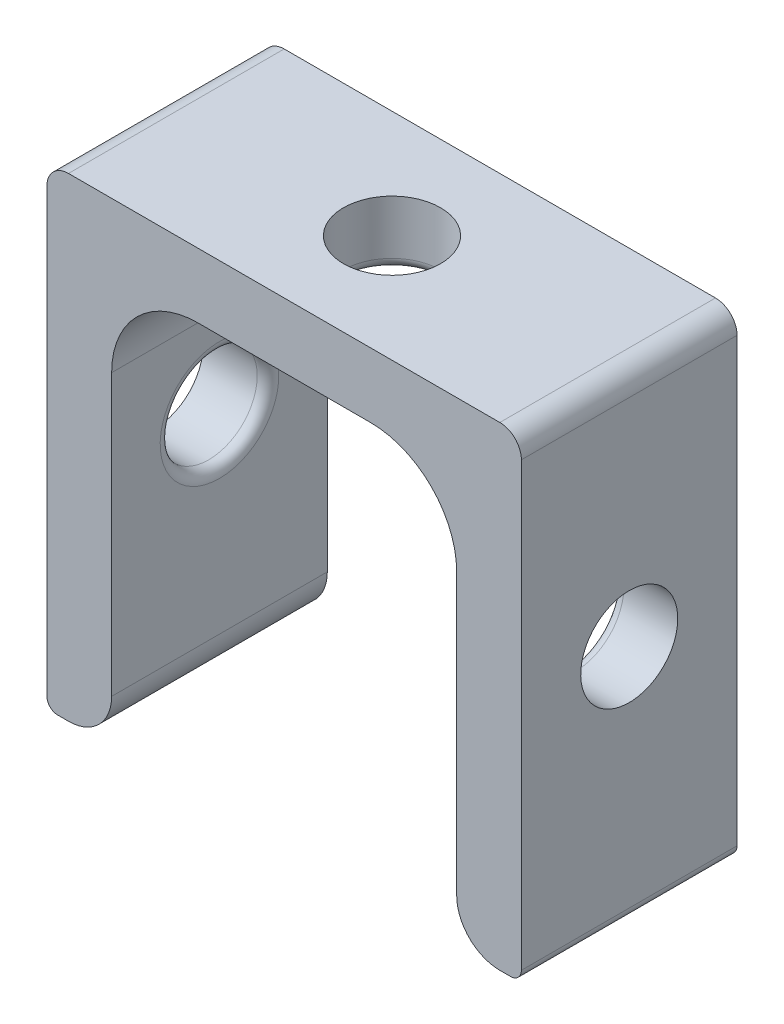
ISO-10303-21;
HEADER;
FILE_DESCRIPTION(('STEP AP214'),'2;1');
FILE_NAME('part.step','',(''),(''),'','','');
FILE_SCHEMA(('AUTOMOTIVE_DESIGN { 1 0 10303 214 1 1 1 1 }'));
ENDSEC;
DATA;
#1=APPLICATION_CONTEXT('core data for automotive mechanical design processes');
#2=APPLICATION_PROTOCOL_DEFINITION('international standard','automotive_design',2000,#1);
#3=PRODUCT_CONTEXT('',#1,'mechanical');
#4=PRODUCT('Part','Part','',(#3));
#5=PRODUCT_RELATED_PRODUCT_CATEGORY('part','',(#4));
#6=PRODUCT_DEFINITION_FORMATION('','',#4);
#7=PRODUCT_DEFINITION_CONTEXT('part definition',#1,'design');
#8=PRODUCT_DEFINITION('design','',#6,#7);
#9=PRODUCT_DEFINITION_SHAPE('','',#8);
#10=(LENGTH_UNIT() NAMED_UNIT(*) SI_UNIT(.MILLI.,.METRE.));
#11=(NAMED_UNIT(*) PLANE_ANGLE_UNIT() SI_UNIT($,.RADIAN.));
#12=(NAMED_UNIT(*) SI_UNIT($,.STERADIAN.) SOLID_ANGLE_UNIT());
#13=UNCERTAINTY_MEASURE_WITH_UNIT(LENGTH_MEASURE(1.E-05),#10,'distance_accuracy_value','');
#14=(GEOMETRIC_REPRESENTATION_CONTEXT(3) GLOBAL_UNCERTAINTY_ASSIGNED_CONTEXT((#13)) GLOBAL_UNIT_ASSIGNED_CONTEXT((#10,
#11,#12)) REPRESENTATION_CONTEXT('',''));
#15=CARTESIAN_POINT('',(0.,0.,0.));
#16=DIRECTION('',(0.,0.,1.));
#17=DIRECTION('',(1.,0.,0.));
#18=AXIS2_PLACEMENT_3D('',#15,#16,#17);
#19=CARTESIAN_POINT('',(-10.5,-18.5,10.));
#20=DIRECTION('',(0.,0.,-1.));
#21=DIRECTION('',(-1.,0.,0.));
#22=AXIS2_PLACEMENT_3D('',#19,#20,#21);
#23=CYLINDRICAL_SURFACE('',#22,0.500000000000002);
#24=CARTESIAN_POINT('',(-10.5,-18.5,0.));
#25=DIRECTION('',(0.,0.,1.));
#26=DIRECTION('',(1.,0.,0.));
#27=AXIS2_PLACEMENT_3D('',#24,#25,#26);
#28=CIRCLE('',#27,0.500000000000002);
#29=CARTESIAN_POINT('',(-11.,-18.5,0.));
#30=VERTEX_POINT('',#29);
#31=CARTESIAN_POINT('',(-10.5,-19.,0.));
#32=VERTEX_POINT('',#31);
#33=EDGE_CURVE('E173',#30,#32,#28,.T.);
#34=ORIENTED_EDGE('',*,*,#33,.T.);
#35=DIRECTION('',(0.,0.,-1.));
#36=VECTOR('',#35,1.);
#37=CARTESIAN_POINT('',(-10.5,-19.,10.));
#38=LINE('',#37,#36);
#39=CARTESIAN_POINT('',(-10.5,-19.,10.));
#40=VERTEX_POINT('',#39);
#41=EDGE_CURVE('E153',#40,#32,#38,.T.);
#42=ORIENTED_EDGE('',*,*,#41,.F.);
#43=CARTESIAN_POINT('',(-10.5,-18.5,10.));
#44=DIRECTION('',(0.,0.,1.));
#45=DIRECTION('',(1.,0.,0.));
#46=AXIS2_PLACEMENT_3D('',#43,#44,#45);
#47=CIRCLE('',#46,0.500000000000002);
#48=CARTESIAN_POINT('',(-11.,-18.5,10.));
#49=VERTEX_POINT('',#48);
#50=EDGE_CURVE('E160',#49,#40,#47,.T.);
#51=ORIENTED_EDGE('',*,*,#50,.F.);
#52=DIRECTION('',(0.,0.,-1.));
#53=VECTOR('',#52,1.);
#54=CARTESIAN_POINT('',(-11.,-18.5,10.));
#55=LINE('',#54,#53);
#56=EDGE_CURVE('E282',#49,#30,#55,.T.);
#57=ORIENTED_EDGE('',*,*,#56,.T.);
#58=EDGE_LOOP('',(#34,#42,#51,#57));
#59=FACE_BOUND('',#58,.T.);
#60=ADVANCED_FACE('F36',(#59),#23,.T.);
#61=CARTESIAN_POINT('',(-10.,-19.,10.));
#62=DIRECTION('',(0.,1.,0.));
#63=DIRECTION('',(0.,0.,1.));
#64=AXIS2_PLACEMENT_3D('',#61,#62,#63);
#65=PLANE('',#64);
#66=DIRECTION('',(1.,0.,0.));
#67=VECTOR('',#66,1.);
#68=CARTESIAN_POINT('',(-10.,-19.,0.));
#69=LINE('',#68,#67);
#70=CARTESIAN_POINT('',(-10.,-19.,0.));
#71=VERTEX_POINT('',#70);
#72=EDGE_CURVE('E299',#32,#71,#69,.T.);
#73=ORIENTED_EDGE('',*,*,#72,.T.);
#74=DIRECTION('',(0.,0.,-1.));
#75=VECTOR('',#74,1.);
#76=CARTESIAN_POINT('',(-10.,-19.,10.));
#77=LINE('',#76,#75);
#78=CARTESIAN_POINT('',(-10.,-19.,10.));
#79=VERTEX_POINT('',#78);
#80=EDGE_CURVE('E156',#79,#71,#77,.T.);
#81=ORIENTED_EDGE('',*,*,#80,.F.);
#82=DIRECTION('',(1.,0.,0.));
#83=VECTOR('',#82,1.);
#84=CARTESIAN_POINT('',(-10.,-19.,10.));
#85=LINE('',#84,#83);
#86=EDGE_CURVE('E149',#40,#79,#85,.T.);
#87=ORIENTED_EDGE('',*,*,#86,.F.);
#88=ORIENTED_EDGE('',*,*,#41,.T.);
#89=EDGE_LOOP('',(#73,#81,#87,#88));
#90=FACE_BOUND('',#89,.T.);
#91=ADVANCED_FACE('F151',(#90),#65,.F.);
#92=CARTESIAN_POINT('',(-10.,-17.,10.));
#93=DIRECTION('',(0.,0.,-1.));
#94=DIRECTION('',(-1.,0.,0.));
#95=AXIS2_PLACEMENT_3D('',#92,#93,#94);
#96=CYLINDRICAL_SURFACE('',#95,2.);
#97=CARTESIAN_POINT('',(-10.,-17.,0.));
#98=DIRECTION('',(0.,0.,1.));
#99=DIRECTION('',(-1.,0.,0.));
#100=AXIS2_PLACEMENT_3D('',#97,#98,#99);
#101=CIRCLE('',#100,2.);
#102=CARTESIAN_POINT('',(-8.,-17.,0.));
#103=VERTEX_POINT('',#102);
#104=EDGE_CURVE('E266',#71,#103,#101,.T.);
#105=ORIENTED_EDGE('',*,*,#104,.T.);
#106=DIRECTION('',(0.,0.,-1.));
#107=VECTOR('',#106,1.);
#108=CARTESIAN_POINT('',(-8.,-17.,10.));
#109=LINE('',#108,#107);
#110=CARTESIAN_POINT('',(-8.,-17.,10.));
#111=VERTEX_POINT('',#110);
#112=EDGE_CURVE('E179',#111,#103,#109,.T.);
#113=ORIENTED_EDGE('',*,*,#112,.F.);
#114=CARTESIAN_POINT('',(-10.,-17.,10.));
#115=DIRECTION('',(0.,0.,1.));
#116=DIRECTION('',(-1.,0.,0.));
#117=AXIS2_PLACEMENT_3D('',#114,#115,#116);
#118=CIRCLE('',#117,2.);
#119=EDGE_CURVE('E159',#79,#111,#118,.T.);
#120=ORIENTED_EDGE('',*,*,#119,.F.);
#121=ORIENTED_EDGE('',*,*,#80,.T.);
#122=EDGE_LOOP('',(#105,#113,#120,#121));
#123=FACE_BOUND('',#122,.T.);
#124=ADVANCED_FACE('F363',(#123),#96,.T.);
#125=CARTESIAN_POINT('',(-8.,0.,10.));
#126=DIRECTION('',(-1.,0.,0.));
#127=DIRECTION('',(0.,-1.,0.));
#128=AXIS2_PLACEMENT_3D('',#125,#126,#127);
#129=PLANE('',#128);
#130=CARTESIAN_POINT('',(-8.,-8.,5.));
#131=DIRECTION('',(-1.,0.,0.));
#132=DIRECTION('',(0.,-1.,0.));
#133=AXIS2_PLACEMENT_3D('',#130,#131,#132);
#134=CIRCLE('',#133,2.75);
#135=CARTESIAN_POINT('',(-8.,-10.75,5.));
#136=VERTEX_POINT('',#135);
#137=EDGE_CURVE('E198',#136,#136,#134,.T.);
#138=ORIENTED_EDGE('',*,*,#137,.T.);
#139=EDGE_LOOP('',(#138));
#140=FACE_BOUND('',#139,.T.);
#141=DIRECTION('',(0.,1.,0.));
#142=VECTOR('',#141,1.);
#143=CARTESIAN_POINT('',(-8.,0.,0.));
#144=LINE('',#143,#142);
#145=CARTESIAN_POINT('',(-8.,-4.,0.));
#146=VERTEX_POINT('',#145);
#147=EDGE_CURVE('E262',#103,#146,#144,.T.);
#148=ORIENTED_EDGE('',*,*,#147,.T.);
#149=DIRECTION('',(0.,0.,-1.));
#150=VECTOR('',#149,1.);
#151=CARTESIAN_POINT('',(-8.,-4.,10.));
#152=LINE('',#151,#150);
#153=CARTESIAN_POINT('',(-8.,-4.,10.));
#154=VERTEX_POINT('',#153);
#155=EDGE_CURVE('E51',#146,#154,#152,.F.);
#156=ORIENTED_EDGE('',*,*,#155,.T.);
#157=DIRECTION('',(0.,1.,0.));
#158=VECTOR('',#157,1.);
#159=CARTESIAN_POINT('',(-8.,0.,10.));
#160=LINE('',#159,#158);
#161=EDGE_CURVE('E296',#111,#154,#160,.T.);
#162=ORIENTED_EDGE('',*,*,#161,.F.);
#163=ORIENTED_EDGE('',*,*,#112,.T.);
#164=EDGE_LOOP('',(#148,#156,#162,#163));
#165=FACE_BOUND('',#164,.T.);
#166=ADVANCED_FACE('F295',(#140,#165),#129,.F.);
#167=CARTESIAN_POINT('',(-8.,0.,10.));
#168=DIRECTION('',(0.,1.,0.));
#169=DIRECTION('',(0.,0.,1.));
#170=AXIS2_PLACEMENT_3D('',#167,#168,#169);
#171=PLANE('',#170);
#172=CARTESIAN_POINT('',(0.,0.,5.));
#173=DIRECTION('',(0.,1.,0.));
#174=DIRECTION('',(0.,0.,1.));
#175=AXIS2_PLACEMENT_3D('',#172,#173,#174);
#176=CIRCLE('',#175,2.75);
#177=CARTESIAN_POINT('',(0.,0.,7.75));
#178=VERTEX_POINT('',#177);
#179=EDGE_CURVE('E174',#178,#178,#176,.T.);
#180=ORIENTED_EDGE('',*,*,#179,.T.);
#181=EDGE_LOOP('',(#180));
#182=FACE_BOUND('',#181,.T.);
#183=DIRECTION('',(1.,0.,0.));
#184=VECTOR('',#183,1.);
#185=CARTESIAN_POINT('',(-8.,0.,0.));
#186=LINE('',#185,#184);
#187=CARTESIAN_POINT('',(-4.,0.,0.));
#188=VERTEX_POINT('',#187);
#189=CARTESIAN_POINT('',(4.,0.,0.));
#190=VERTEX_POINT('',#189);
#191=EDGE_CURVE('E256',#188,#190,#186,.T.);
#192=ORIENTED_EDGE('',*,*,#191,.T.);
#193=DIRECTION('',(0.,0.,-1.));
#194=VECTOR('',#193,1.);
#195=CARTESIAN_POINT('',(4.,0.,10.));
#196=LINE('',#195,#194);
#197=CARTESIAN_POINT('',(4.,0.,10.));
#198=VERTEX_POINT('',#197);
#199=EDGE_CURVE('E228',#190,#198,#196,.F.);
#200=ORIENTED_EDGE('',*,*,#199,.T.);
#201=DIRECTION('',(1.,0.,0.));
#202=VECTOR('',#201,1.);
#203=CARTESIAN_POINT('',(-8.,0.,10.));
#204=LINE('',#203,#202);
#205=CARTESIAN_POINT('',(-4.,0.,10.));
#206=VERTEX_POINT('',#205);
#207=EDGE_CURVE('E240',#206,#198,#204,.T.);
#208=ORIENTED_EDGE('',*,*,#207,.F.);
#209=DIRECTION('',(0.,0.,-1.));
#210=VECTOR('',#209,1.);
#211=CARTESIAN_POINT('',(-4.,0.,0.));
#212=LINE('',#211,#210);
#213=EDGE_CURVE('E225',#206,#188,#212,.T.);
#214=ORIENTED_EDGE('',*,*,#213,.T.);
#215=EDGE_LOOP('',(#192,#200,#208,#214));
#216=FACE_BOUND('',#215,.T.);
#217=ADVANCED_FACE('F260',(#182,#216),#171,.F.);
#218=CARTESIAN_POINT('',(8.,0.,10.));
#219=DIRECTION('',(1.,0.,0.));
#220=DIRECTION('',(0.,1.,0.));
#221=AXIS2_PLACEMENT_3D('',#218,#219,#220);
#222=PLANE('',#221);
#223=CARTESIAN_POINT('',(8.,-8.,5.));
#224=DIRECTION('',(1.,0.,0.));
#225=DIRECTION('',(0.,1.,0.));
#226=AXIS2_PLACEMENT_3D('',#223,#224,#225);
#227=CIRCLE('',#226,2.75);
#228=CARTESIAN_POINT('',(8.,-5.25,5.));
#229=VERTEX_POINT('',#228);
#230=EDGE_CURVE('E192',#229,#229,#227,.T.);
#231=ORIENTED_EDGE('',*,*,#230,.T.);
#232=EDGE_LOOP('',(#231));
#233=FACE_BOUND('',#232,.T.);
#234=DIRECTION('',(0.,-1.,0.));
#235=VECTOR('',#234,1.);
#236=CARTESIAN_POINT('',(8.,0.,10.));
#237=LINE('',#236,#235);
#238=CARTESIAN_POINT('',(8.,-4.,10.));
#239=VERTEX_POINT('',#238);
#240=CARTESIAN_POINT('',(8.,-17.,10.));
#241=VERTEX_POINT('',#240);
#242=EDGE_CURVE('E237',#239,#241,#237,.T.);
#243=ORIENTED_EDGE('',*,*,#242,.F.);
#244=DIRECTION('',(0.,0.,-1.));
#245=VECTOR('',#244,1.);
#246=CARTESIAN_POINT('',(8.,-4.,0.));
#247=LINE('',#246,#245);
#248=CARTESIAN_POINT('',(8.,-4.,0.));
#249=VERTEX_POINT('',#248);
#250=EDGE_CURVE('E222',#239,#249,#247,.T.);
#251=ORIENTED_EDGE('',*,*,#250,.T.);
#252=DIRECTION('',(0.,-1.,0.));
#253=VECTOR('',#252,1.);
#254=CARTESIAN_POINT('',(8.,0.,0.));
#255=LINE('',#254,#253);
#256=CARTESIAN_POINT('',(8.,-17.,0.));
#257=VERTEX_POINT('',#256);
#258=EDGE_CURVE('E258',#249,#257,#255,.T.);
#259=ORIENTED_EDGE('',*,*,#258,.T.);
#260=DIRECTION('',(0.,0.,-1.));
#261=VECTOR('',#260,1.);
#262=CARTESIAN_POINT('',(8.,-17.,10.));
#263=LINE('',#262,#261);
#264=EDGE_CURVE('E248',#241,#257,#263,.T.);
#265=ORIENTED_EDGE('',*,*,#264,.F.);
#266=EDGE_LOOP('',(#243,#251,#259,#265));
#267=FACE_BOUND('',#266,.T.);
#268=ADVANCED_FACE('F245',(#233,#267),#222,.F.);
#269=CARTESIAN_POINT('',(10.,-17.,10.));
#270=DIRECTION('',(0.,0.,-1.));
#271=DIRECTION('',(-1.,0.,0.));
#272=AXIS2_PLACEMENT_3D('',#269,#270,#271);
#273=CYLINDRICAL_SURFACE('',#272,2.);
#274=CARTESIAN_POINT('',(10.,-17.,0.));
#275=DIRECTION('',(0.,0.,1.));
#276=DIRECTION('',(1.,0.,0.));
#277=AXIS2_PLACEMENT_3D('',#274,#275,#276);
#278=CIRCLE('',#277,2.);
#279=CARTESIAN_POINT('',(10.,-19.,0.));
#280=VERTEX_POINT('',#279);
#281=EDGE_CURVE('E264',#257,#280,#278,.T.);
#282=ORIENTED_EDGE('',*,*,#281,.T.);
#283=DIRECTION('',(0.,0.,-1.));
#284=VECTOR('',#283,1.);
#285=CARTESIAN_POINT('',(10.,-19.,10.));
#286=LINE('',#285,#284);
#287=CARTESIAN_POINT('',(10.,-19.,10.));
#288=VERTEX_POINT('',#287);
#289=EDGE_CURVE('E290',#288,#280,#286,.T.);
#290=ORIENTED_EDGE('',*,*,#289,.F.);
#291=CARTESIAN_POINT('',(10.,-17.,10.));
#292=DIRECTION('',(0.,0.,1.));
#293=DIRECTION('',(1.,0.,0.));
#294=AXIS2_PLACEMENT_3D('',#291,#292,#293);
#295=CIRCLE('',#294,2.);
#296=EDGE_CURVE('E250',#241,#288,#295,.T.);
#297=ORIENTED_EDGE('',*,*,#296,.F.);
#298=ORIENTED_EDGE('',*,*,#264,.T.);
#299=EDGE_LOOP('',(#282,#290,#297,#298));
#300=FACE_BOUND('',#299,.T.);
#301=ADVANCED_FACE('F402',(#300),#273,.T.);
#302=CARTESIAN_POINT('',(10.,-19.,10.));
#303=DIRECTION('',(0.,1.,0.));
#304=DIRECTION('',(0.,0.,1.));
#305=AXIS2_PLACEMENT_3D('',#302,#303,#304);
#306=PLANE('',#305);
#307=DIRECTION('',(1.,0.,0.));
#308=VECTOR('',#307,1.);
#309=CARTESIAN_POINT('',(10.,-19.,0.));
#310=LINE('',#309,#308);
#311=CARTESIAN_POINT('',(10.5,-19.,0.));
#312=VERTEX_POINT('',#311);
#313=EDGE_CURVE('E271',#280,#312,#310,.T.);
#314=ORIENTED_EDGE('',*,*,#313,.T.);
#315=DIRECTION('',(0.,0.,-1.));
#316=VECTOR('',#315,1.);
#317=CARTESIAN_POINT('',(10.5,-19.,10.));
#318=LINE('',#317,#316);
#319=CARTESIAN_POINT('',(10.5,-19.,10.));
#320=VERTEX_POINT('',#319);
#321=EDGE_CURVE('E287',#320,#312,#318,.T.);
#322=ORIENTED_EDGE('',*,*,#321,.F.);
#323=DIRECTION('',(1.,0.,0.));
#324=VECTOR('',#323,1.);
#325=CARTESIAN_POINT('',(10.,-19.,10.));
#326=LINE('',#325,#324);
#327=EDGE_CURVE('E311',#288,#320,#326,.T.);
#328=ORIENTED_EDGE('',*,*,#327,.F.);
#329=ORIENTED_EDGE('',*,*,#289,.T.);
#330=EDGE_LOOP('',(#314,#322,#328,#329));
#331=FACE_BOUND('',#330,.T.);
#332=ADVANCED_FACE('F406',(#331),#306,.F.);
#333=CARTESIAN_POINT('',(10.5,-18.5,10.));
#334=DIRECTION('',(0.,0.,-1.));
#335=DIRECTION('',(-1.,0.,0.));
#336=AXIS2_PLACEMENT_3D('',#333,#334,#335);
#337=CYLINDRICAL_SURFACE('',#336,0.500000000000002);
#338=CARTESIAN_POINT('',(10.5,-18.5,0.));
#339=DIRECTION('',(0.,0.,1.));
#340=DIRECTION('',(-1.,0.,0.));
#341=AXIS2_PLACEMENT_3D('',#338,#339,#340);
#342=CIRCLE('',#341,0.500000000000002);
#343=CARTESIAN_POINT('',(11.,-18.5,0.));
#344=VERTEX_POINT('',#343);
#345=EDGE_CURVE('E273',#312,#344,#342,.T.);
#346=ORIENTED_EDGE('',*,*,#345,.T.);
#347=DIRECTION('',(0.,0.,-1.));
#348=VECTOR('',#347,1.);
#349=CARTESIAN_POINT('',(11.,-18.5,10.));
#350=LINE('',#349,#348);
#351=CARTESIAN_POINT('',(11.,-18.5,10.));
#352=VERTEX_POINT('',#351);
#353=EDGE_CURVE('E284',#352,#344,#350,.T.);
#354=ORIENTED_EDGE('',*,*,#353,.F.);
#355=CARTESIAN_POINT('',(10.5,-18.5,10.));
#356=DIRECTION('',(0.,0.,1.));
#357=DIRECTION('',(-1.,0.,0.));
#358=AXIS2_PLACEMENT_3D('',#355,#356,#357);
#359=CIRCLE('',#358,0.500000000000002);
#360=EDGE_CURVE('E309',#320,#352,#359,.T.);
#361=ORIENTED_EDGE('',*,*,#360,.F.);
#362=ORIENTED_EDGE('',*,*,#321,.T.);
#363=EDGE_LOOP('',(#346,#354,#361,#362));
#364=FACE_BOUND('',#363,.T.);
#365=ADVANCED_FACE('F326',(#364),#337,.T.);
#366=CARTESIAN_POINT('',(11.,-18.5,10.));
#367=DIRECTION('',(-1.,0.,0.));
#368=DIRECTION('',(0.,-1.,0.));
#369=AXIS2_PLACEMENT_3D('',#366,#367,#368);
#370=PLANE('',#369);
#371=CARTESIAN_POINT('',(11.,-8.,5.));
#372=DIRECTION('',(1.,0.,0.));
#373=DIRECTION('',(0.,1.,0.));
#374=AXIS2_PLACEMENT_3D('',#371,#372,#373);
#375=CIRCLE('',#374,2.25);
#376=CARTESIAN_POINT('',(11.,-5.75,5.));
#377=VERTEX_POINT('',#376);
#378=EDGE_CURVE('E188',#377,#377,#375,.T.);
#379=ORIENTED_EDGE('',*,*,#378,.F.);
#380=EDGE_LOOP('',(#379));
#381=FACE_BOUND('',#380,.T.);
#382=DIRECTION('',(0.,1.,0.));
#383=VECTOR('',#382,1.);
#384=CARTESIAN_POINT('',(11.,-18.5,0.));
#385=LINE('',#384,#383);
#386=CARTESIAN_POINT('',(11.,2.,0.));
#387=VERTEX_POINT('',#386);
#388=EDGE_CURVE('E275',#344,#387,#385,.T.);
#389=ORIENTED_EDGE('',*,*,#388,.T.);
#390=DIRECTION('',(0.,0.,-1.));
#391=VECTOR('',#390,1.);
#392=CARTESIAN_POINT('',(11.,2.,10.));
#393=LINE('',#392,#391);
#394=CARTESIAN_POINT('',(11.,2.,10.));
#395=VERTEX_POINT('',#394);
#396=EDGE_CURVE('E213',#387,#395,#393,.F.);
#397=ORIENTED_EDGE('',*,*,#396,.T.);
#398=DIRECTION('',(0.,1.,0.));
#399=VECTOR('',#398,1.);
#400=CARTESIAN_POINT('',(11.,-18.5,10.));
#401=LINE('',#400,#399);
#402=EDGE_CURVE('E307',#352,#395,#401,.T.);
#403=ORIENTED_EDGE('',*,*,#402,.F.);
#404=ORIENTED_EDGE('',*,*,#353,.T.);
#405=EDGE_LOOP('',(#389,#397,#403,#404));
#406=FACE_BOUND('',#405,.T.);
#407=ADVANCED_FACE('F322',(#381,#406),#370,.F.);
#408=CARTESIAN_POINT('',(-11.,3.,10.));
#409=DIRECTION('',(0.,-1.,0.));
#410=DIRECTION('',(0.,0.,-1.));
#411=AXIS2_PLACEMENT_3D('',#408,#409,#410);
#412=PLANE('',#411);
#413=CARTESIAN_POINT('',(0.,3.,5.));
#414=DIRECTION('',(0.,-1.,0.));
#415=DIRECTION('',(0.,0.,-1.));
#416=AXIS2_PLACEMENT_3D('',#413,#414,#415);
#417=CIRCLE('',#416,2.25);
#418=CARTESIAN_POINT('',(0.,3.,2.75));
#419=VERTEX_POINT('',#418);
#420=EDGE_CURVE('E183',#419,#419,#417,.F.);
#421=ORIENTED_EDGE('',*,*,#420,.F.);
#422=EDGE_LOOP('',(#421));
#423=FACE_BOUND('',#422,.T.);
#424=DIRECTION('',(-1.,0.,0.));
#425=VECTOR('',#424,1.);
#426=CARTESIAN_POINT('',(-11.,3.,10.));
#427=LINE('',#426,#425);
#428=CARTESIAN_POINT('',(9.99999999999999,3.,10.));
#429=VERTEX_POINT('',#428);
#430=CARTESIAN_POINT('',(-9.99999999999999,3.,10.));
#431=VERTEX_POINT('',#430);
#432=EDGE_CURVE('E304',#429,#431,#427,.T.);
#433=ORIENTED_EDGE('',*,*,#432,.F.);
#434=DIRECTION('',(0.,0.,-1.));
#435=VECTOR('',#434,1.);
#436=CARTESIAN_POINT('',(9.99999999999999,3.,10.));
#437=LINE('',#436,#435);
#438=CARTESIAN_POINT('',(9.99999999999999,3.,0.));
#439=VERTEX_POINT('',#438);
#440=EDGE_CURVE('E206',#429,#439,#437,.T.);
#441=ORIENTED_EDGE('',*,*,#440,.T.);
#442=DIRECTION('',(-1.,0.,0.));
#443=VECTOR('',#442,1.);
#444=CARTESIAN_POINT('',(-11.,3.,0.));
#445=LINE('',#444,#443);
#446=CARTESIAN_POINT('',(-9.99999999999999,3.,0.));
#447=VERTEX_POINT('',#446);
#448=EDGE_CURVE('E278',#439,#447,#445,.T.);
#449=ORIENTED_EDGE('',*,*,#448,.T.);
#450=DIRECTION('',(0.,0.,-1.));
#451=VECTOR('',#450,1.);
#452=CARTESIAN_POINT('',(-9.99999999999999,3.,10.));
#453=LINE('',#452,#451);
#454=EDGE_CURVE('E204',#447,#431,#453,.F.);
#455=ORIENTED_EDGE('',*,*,#454,.T.);
#456=EDGE_LOOP('',(#433,#441,#449,#455));
#457=FACE_BOUND('',#456,.T.);
#458=ADVANCED_FACE('F325',(#423,#457),#412,.F.);
#459=CARTESIAN_POINT('',(-11.,-18.5,10.));
#460=DIRECTION('',(1.,0.,0.));
#461=DIRECTION('',(0.,1.,0.));
#462=AXIS2_PLACEMENT_3D('',#459,#460,#461);
#463=PLANE('',#462);
#464=CARTESIAN_POINT('',(-11.,-8.,5.));
#465=DIRECTION('',(1.,0.,0.));
#466=DIRECTION('',(0.,1.,0.));
#467=AXIS2_PLACEMENT_3D('',#464,#465,#466);
#468=CIRCLE('',#467,2.25);
#469=CARTESIAN_POINT('',(-11.,-5.75,5.));
#470=VERTEX_POINT('',#469);
#471=EDGE_CURVE('E186',#470,#470,#468,.T.);
#472=ORIENTED_EDGE('',*,*,#471,.T.);
#473=EDGE_LOOP('',(#472));
#474=FACE_BOUND('',#473,.T.);
#475=DIRECTION('',(0.,-1.,0.));
#476=VECTOR('',#475,1.);
#477=CARTESIAN_POINT('',(-11.,-18.5,10.));
#478=LINE('',#477,#476);
#479=CARTESIAN_POINT('',(-11.,2.,10.));
#480=VERTEX_POINT('',#479);
#481=EDGE_CURVE('E166',#480,#49,#478,.T.);
#482=ORIENTED_EDGE('',*,*,#481,.F.);
#483=DIRECTION('',(0.,0.,-1.));
#484=VECTOR('',#483,1.);
#485=CARTESIAN_POINT('',(-11.,2.,10.));
#486=LINE('',#485,#484);
#487=CARTESIAN_POINT('',(-11.,2.,0.));
#488=VERTEX_POINT('',#487);
#489=EDGE_CURVE('E219',#480,#488,#486,.T.);
#490=ORIENTED_EDGE('',*,*,#489,.T.);
#491=DIRECTION('',(0.,-1.,0.));
#492=VECTOR('',#491,1.);
#493=CARTESIAN_POINT('',(-11.,-18.5,0.));
#494=LINE('',#493,#492);
#495=EDGE_CURVE('E170',#488,#30,#494,.T.);
#496=ORIENTED_EDGE('',*,*,#495,.T.);
#497=ORIENTED_EDGE('',*,*,#56,.F.);
#498=EDGE_LOOP('',(#482,#490,#496,#497));
#499=FACE_BOUND('',#498,.T.);
#500=ADVANCED_FACE('F345',(#474,#499),#463,.F.);
#501=CARTESIAN_POINT('',(-10.5,-18.5,10.));
#502=DIRECTION('',(0.,0.,1.));
#503=DIRECTION('',(1.,0.,0.));
#504=AXIS2_PLACEMENT_3D('',#501,#502,#503);
#505=PLANE('',#504);
#506=ORIENTED_EDGE('',*,*,#402,.T.);
#507=CARTESIAN_POINT('',(9.99999999999999,2.,10.));
#508=DIRECTION('',(0.,0.,1.));
#509=DIRECTION('',(1.,0.,0.));
#510=AXIS2_PLACEMENT_3D('',#507,#508,#509);
#511=CIRCLE('',#510,1.);
#512=EDGE_CURVE('E217',#395,#429,#511,.T.);
#513=ORIENTED_EDGE('',*,*,#512,.T.);
#514=ORIENTED_EDGE('',*,*,#432,.T.);
#515=CARTESIAN_POINT('',(-9.99999999999999,2.,10.));
#516=DIRECTION('',(0.,0.,1.));
#517=DIRECTION('',(1.,0.,0.));
#518=AXIS2_PLACEMENT_3D('',#515,#516,#517);
#519=CIRCLE('',#518,1.);
#520=EDGE_CURVE('E215',#431,#480,#519,.T.);
#521=ORIENTED_EDGE('',*,*,#520,.T.);
#522=ORIENTED_EDGE('',*,*,#481,.T.);
#523=ORIENTED_EDGE('',*,*,#50,.T.);
#524=ORIENTED_EDGE('',*,*,#86,.T.);
#525=ORIENTED_EDGE('',*,*,#119,.T.);
#526=ORIENTED_EDGE('',*,*,#161,.T.);
#527=CARTESIAN_POINT('',(-4.,-4.,10.));
#528=DIRECTION('',(0.,0.,1.));
#529=DIRECTION('',(1.,0.,0.));
#530=AXIS2_PLACEMENT_3D('',#527,#528,#529);
#531=CIRCLE('',#530,4.);
#532=EDGE_CURVE('E11',#154,#206,#531,.F.);
#533=ORIENTED_EDGE('',*,*,#532,.T.);
#534=ORIENTED_EDGE('',*,*,#207,.T.);
#535=CARTESIAN_POINT('',(4.,-4.,10.));
#536=DIRECTION('',(0.,0.,1.));
#537=DIRECTION('',(1.,0.,0.));
#538=AXIS2_PLACEMENT_3D('',#535,#536,#537);
#539=CIRCLE('',#538,4.);
#540=EDGE_CURVE('E233',#198,#239,#539,.F.);
#541=ORIENTED_EDGE('',*,*,#540,.T.);
#542=ORIENTED_EDGE('',*,*,#242,.T.);
#543=ORIENTED_EDGE('',*,*,#296,.T.);
#544=ORIENTED_EDGE('',*,*,#327,.T.);
#545=ORIENTED_EDGE('',*,*,#360,.T.);
#546=EDGE_LOOP('',(#506,#513,#514,#521,#522,#523,#524,#525,#526,#533,#534,#541,#542,#543,#544,#545));
#547=FACE_BOUND('',#546,.T.);
#548=ADVANCED_FACE('F164',(#547),#505,.T.);
#549=CARTESIAN_POINT('',(-10.5,-18.5,0.));
#550=DIRECTION('',(0.,0.,1.));
#551=DIRECTION('',(1.,0.,0.));
#552=AXIS2_PLACEMENT_3D('',#549,#550,#551);
#553=PLANE('',#552);
#554=ORIENTED_EDGE('',*,*,#448,.F.);
#555=CARTESIAN_POINT('',(9.99999999999999,2.,0.));
#556=DIRECTION('',(0.,0.,1.));
#557=DIRECTION('',(1.,0.,0.));
#558=AXIS2_PLACEMENT_3D('',#555,#556,#557);
#559=CIRCLE('',#558,1.);
#560=EDGE_CURVE('E211',#439,#387,#559,.F.);
#561=ORIENTED_EDGE('',*,*,#560,.T.);
#562=ORIENTED_EDGE('',*,*,#388,.F.);
#563=ORIENTED_EDGE('',*,*,#345,.F.);
#564=ORIENTED_EDGE('',*,*,#313,.F.);
#565=ORIENTED_EDGE('',*,*,#281,.F.);
#566=ORIENTED_EDGE('',*,*,#258,.F.);
#567=CARTESIAN_POINT('',(4.,-4.,0.));
#568=DIRECTION('',(0.,0.,1.));
#569=DIRECTION('',(1.,0.,0.));
#570=AXIS2_PLACEMENT_3D('',#567,#568,#569);
#571=CIRCLE('',#570,4.);
#572=EDGE_CURVE('E231',#249,#190,#571,.T.);
#573=ORIENTED_EDGE('',*,*,#572,.T.);
#574=ORIENTED_EDGE('',*,*,#191,.F.);
#575=CARTESIAN_POINT('',(-4.,-4.,0.));
#576=DIRECTION('',(0.,0.,1.));
#577=DIRECTION('',(1.,0.,0.));
#578=AXIS2_PLACEMENT_3D('',#575,#576,#577);
#579=CIRCLE('',#578,4.);
#580=EDGE_CURVE('E44',#188,#146,#579,.T.);
#581=ORIENTED_EDGE('',*,*,#580,.T.);
#582=ORIENTED_EDGE('',*,*,#147,.F.);
#583=ORIENTED_EDGE('',*,*,#104,.F.);
#584=ORIENTED_EDGE('',*,*,#72,.F.);
#585=ORIENTED_EDGE('',*,*,#33,.F.);
#586=ORIENTED_EDGE('',*,*,#495,.F.);
#587=CARTESIAN_POINT('',(-9.99999999999999,2.,0.));
#588=DIRECTION('',(0.,0.,1.));
#589=DIRECTION('',(1.,0.,0.));
#590=AXIS2_PLACEMENT_3D('',#587,#588,#589);
#591=CIRCLE('',#590,1.);
#592=EDGE_CURVE('E209',#488,#447,#591,.F.);
#593=ORIENTED_EDGE('',*,*,#592,.T.);
#594=EDGE_LOOP('',(#554,#561,#562,#563,#564,#565,#566,#573,#574,#581,#582,#583,#584,#585,#586,#593));
#595=FACE_BOUND('',#594,.T.);
#596=ADVANCED_FACE('F255',(#595),#553,.F.);
#597=CARTESIAN_POINT('',(0.,10.,5.));
#598=DIRECTION('',(0.,-1.,0.));
#599=DIRECTION('',(0.,0.,-1.));
#600=AXIS2_PLACEMENT_3D('',#597,#598,#599);
#601=CYLINDRICAL_SURFACE('',#600,2.25);
#602=CARTESIAN_POINT('',(0.,0.5,5.));
#603=DIRECTION('',(0.,1.,0.));
#604=DIRECTION('',(0.,0.,1.));
#605=AXIS2_PLACEMENT_3D('',#602,#603,#604);
#606=CIRCLE('',#605,2.25);
#607=CARTESIAN_POINT('',(0.,0.5,7.25));
#608=VERTEX_POINT('',#607);
#609=EDGE_CURVE('E177',#608,#608,#606,.F.);
#610=ORIENTED_EDGE('',*,*,#609,.T.);
#611=EDGE_LOOP('',(#610));
#612=FACE_BOUND('',#611,.T.);
#613=ORIENTED_EDGE('',*,*,#420,.T.);
#614=EDGE_LOOP('',(#613));
#615=FACE_BOUND('',#614,.T.);
#616=ADVANCED_FACE('F484',(#612,#615),#601,.F.);
#617=CARTESIAN_POINT('',(-16.,-8.,5.));
#618=DIRECTION('',(1.,0.,0.));
#619=DIRECTION('',(0.,1.,0.));
#620=AXIS2_PLACEMENT_3D('',#617,#618,#619);
#621=CYLINDRICAL_SURFACE('',#620,2.25);
#622=CARTESIAN_POINT('',(-8.5,-8.,5.));
#623=DIRECTION('',(-1.,0.,0.));
#624=DIRECTION('',(0.,-1.,0.));
#625=AXIS2_PLACEMENT_3D('',#622,#623,#624);
#626=CIRCLE('',#625,2.25);
#627=CARTESIAN_POINT('',(-8.5,-10.25,5.));
#628=VERTEX_POINT('',#627);
#629=EDGE_CURVE('E201',#628,#628,#626,.F.);
#630=ORIENTED_EDGE('',*,*,#629,.T.);
#631=EDGE_LOOP('',(#630));
#632=FACE_BOUND('',#631,.T.);
#633=ORIENTED_EDGE('',*,*,#471,.F.);
#634=EDGE_LOOP('',(#633));
#635=FACE_BOUND('',#634,.T.);
#636=ADVANCED_FACE('F499',(#632,#635),#621,.F.);
#637=CARTESIAN_POINT('',(8.5,-8.,5.));
#638=DIRECTION('',(1.,0.,0.));
#639=DIRECTION('',(0.,1.,0.));
#640=AXIS2_PLACEMENT_3D('',#637,#638,#639);
#641=CIRCLE('',#640,2.25);
#642=CARTESIAN_POINT('',(8.5,-5.75,5.));
#643=VERTEX_POINT('',#642);
#644=EDGE_CURVE('E195',#643,#643,#641,.F.);
#645=ORIENTED_EDGE('',*,*,#644,.T.);
#646=EDGE_LOOP('',(#645));
#647=FACE_BOUND('',#646,.T.);
#648=ORIENTED_EDGE('',*,*,#378,.T.);
#649=EDGE_LOOP('',(#648));
#650=FACE_BOUND('',#649,.T.);
#651=ADVANCED_FACE('F320',(#647,#650),#621,.F.);
#652=CARTESIAN_POINT('',(0.,0.5,5.));
#653=DIRECTION('',(0.,1.,0.));
#654=DIRECTION('',(0.,0.,1.));
#655=AXIS2_PLACEMENT_3D('',#652,#653,#654);
#656=TOROIDAL_SURFACE('',#655,2.75,0.5);
#657=ORIENTED_EDGE('',*,*,#609,.F.);
#658=EDGE_LOOP('',(#657));
#659=FACE_BOUND('',#658,.T.);
#660=ORIENTED_EDGE('',*,*,#179,.F.);
#661=EDGE_LOOP('',(#660));
#662=FACE_BOUND('',#661,.T.);
#663=ADVANCED_FACE('F367',(#659,#662),#656,.T.);
#664=CARTESIAN_POINT('',(8.5,-8.,5.));
#665=DIRECTION('',(1.,0.,0.));
#666=DIRECTION('',(0.,1.,0.));
#667=AXIS2_PLACEMENT_3D('',#664,#665,#666);
#668=TOROIDAL_SURFACE('',#667,2.75,0.5);
#669=ORIENTED_EDGE('',*,*,#644,.F.);
#670=EDGE_LOOP('',(#669));
#671=FACE_BOUND('',#670,.T.);
#672=ORIENTED_EDGE('',*,*,#230,.F.);
#673=EDGE_LOOP('',(#672));
#674=FACE_BOUND('',#673,.T.);
#675=ADVANCED_FACE('F370',(#671,#674),#668,.T.);
#676=CARTESIAN_POINT('',(-8.5,-8.,5.));
#677=DIRECTION('',(-1.,0.,0.));
#678=DIRECTION('',(0.,-1.,0.));
#679=AXIS2_PLACEMENT_3D('',#676,#677,#678);
#680=TOROIDAL_SURFACE('',#679,2.75,0.5);
#681=ORIENTED_EDGE('',*,*,#629,.F.);
#682=EDGE_LOOP('',(#681));
#683=FACE_BOUND('',#682,.T.);
#684=ORIENTED_EDGE('',*,*,#137,.F.);
#685=EDGE_LOOP('',(#684));
#686=FACE_BOUND('',#685,.T.);
#687=ADVANCED_FACE('F374',(#683,#686),#680,.T.);
#688=CARTESIAN_POINT('',(9.99999999999999,2.,10.));
#689=DIRECTION('',(0.,0.,-1.));
#690=DIRECTION('',(-1.,0.,0.));
#691=AXIS2_PLACEMENT_3D('',#688,#689,#690);
#692=CYLINDRICAL_SURFACE('',#691,1.);
#693=ORIENTED_EDGE('',*,*,#512,.F.);
#694=ORIENTED_EDGE('',*,*,#396,.F.);
#695=ORIENTED_EDGE('',*,*,#560,.F.);
#696=ORIENTED_EDGE('',*,*,#440,.F.);
#697=EDGE_LOOP('',(#693,#694,#695,#696));
#698=FACE_BOUND('',#697,.T.);
#699=ADVANCED_FACE('F335',(#698),#692,.T.);
#700=CARTESIAN_POINT('',(-9.99999999999999,2.,10.));
#701=DIRECTION('',(0.,0.,-1.));
#702=DIRECTION('',(-1.,0.,0.));
#703=AXIS2_PLACEMENT_3D('',#700,#701,#702);
#704=CYLINDRICAL_SURFACE('',#703,1.);
#705=ORIENTED_EDGE('',*,*,#520,.F.);
#706=ORIENTED_EDGE('',*,*,#454,.F.);
#707=ORIENTED_EDGE('',*,*,#592,.F.);
#708=ORIENTED_EDGE('',*,*,#489,.F.);
#709=EDGE_LOOP('',(#705,#706,#707,#708));
#710=FACE_BOUND('',#709,.T.);
#711=ADVANCED_FACE('F342',(#710),#704,.T.);
#712=CARTESIAN_POINT('',(4.,-4.,10.));
#713=DIRECTION('',(0.,0.,1.));
#714=DIRECTION('',(1.,0.,0.));
#715=AXIS2_PLACEMENT_3D('',#712,#713,#714);
#716=CYLINDRICAL_SURFACE('',#715,4.);
#717=ORIENTED_EDGE('',*,*,#540,.F.);
#718=ORIENTED_EDGE('',*,*,#199,.F.);
#719=ORIENTED_EDGE('',*,*,#572,.F.);
#720=ORIENTED_EDGE('',*,*,#250,.F.);
#721=EDGE_LOOP('',(#717,#718,#719,#720));
#722=FACE_BOUND('',#721,.T.);
#723=ADVANCED_FACE('F252',(#722),#716,.F.);
#724=CARTESIAN_POINT('',(-4.,-4.,10.));
#725=DIRECTION('',(0.,0.,1.));
#726=DIRECTION('',(1.,0.,0.));
#727=AXIS2_PLACEMENT_3D('',#724,#725,#726);
#728=CYLINDRICAL_SURFACE('',#727,4.);
#729=ORIENTED_EDGE('',*,*,#532,.F.);
#730=ORIENTED_EDGE('',*,*,#155,.F.);
#731=ORIENTED_EDGE('',*,*,#580,.F.);
#732=ORIENTED_EDGE('',*,*,#213,.F.);
#733=EDGE_LOOP('',(#729,#730,#731,#732));
#734=FACE_BOUND('',#733,.T.);
#735=ADVANCED_FACE('F38',(#734),#728,.F.);
#736=CLOSED_SHELL('',(#60,#91,#124,#166,#217,#268,#301,#332,#365,#407,#458,#500,#548,#596,#616,
#636,#651,#663,#675,#687,#699,#711,#723,#735));
#737=MANIFOLD_SOLID_BREP('B2',#736);
#738=ADVANCED_BREP_SHAPE_REPRESENTATION('',(#18,#737),#14);
#739=SHAPE_DEFINITION_REPRESENTATION(#9,#738);
ENDSEC;
END-ISO-10303-21;
